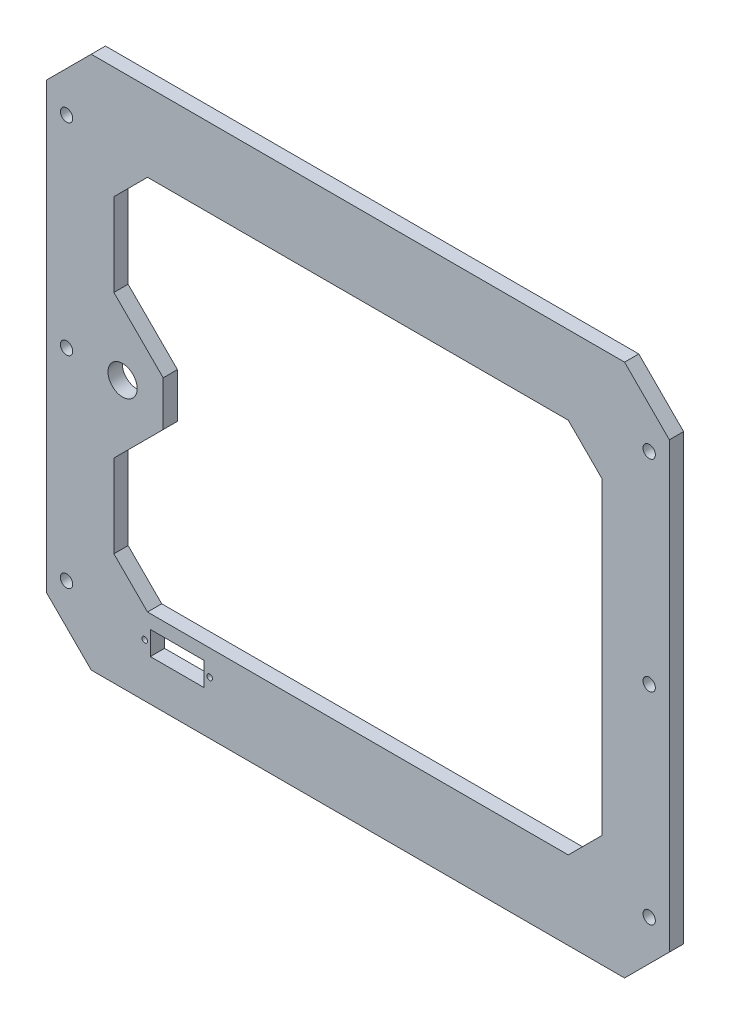
ISO-10303-21;
HEADER;
FILE_DESCRIPTION(('STEP AP214'),'2;1');
FILE_NAME('part.step','',(''),(''),'','','');
FILE_SCHEMA(('AUTOMOTIVE_DESIGN { 1 0 10303 214 1 1 1 1 }'));
ENDSEC;
DATA;
#1=APPLICATION_CONTEXT('core data for automotive mechanical design processes');
#2=APPLICATION_PROTOCOL_DEFINITION('international standard','automotive_design',2000,#1);
#3=PRODUCT_CONTEXT('',#1,'mechanical');
#4=PRODUCT('Part','Part','',(#3));
#5=PRODUCT_RELATED_PRODUCT_CATEGORY('part','',(#4));
#6=PRODUCT_DEFINITION_FORMATION('','',#4);
#7=PRODUCT_DEFINITION_CONTEXT('part definition',#1,'design');
#8=PRODUCT_DEFINITION('design','',#6,#7);
#9=PRODUCT_DEFINITION_SHAPE('','',#8);
#10=(LENGTH_UNIT() NAMED_UNIT(*) SI_UNIT(.MILLI.,.METRE.));
#11=(NAMED_UNIT(*) PLANE_ANGLE_UNIT() SI_UNIT($,.RADIAN.));
#12=(NAMED_UNIT(*) SI_UNIT($,.STERADIAN.) SOLID_ANGLE_UNIT());
#13=UNCERTAINTY_MEASURE_WITH_UNIT(LENGTH_MEASURE(1.E-05),#10,'distance_accuracy_value','');
#14=(GEOMETRIC_REPRESENTATION_CONTEXT(3) GLOBAL_UNCERTAINTY_ASSIGNED_CONTEXT((#13)) GLOBAL_UNIT_ASSIGNED_CONTEXT((#10,
#11,#12)) REPRESENTATION_CONTEXT('',''));
#15=CARTESIAN_POINT('',(0.,0.,0.));
#16=DIRECTION('',(0.,0.,1.));
#17=DIRECTION('',(1.,0.,0.));
#18=AXIS2_PLACEMENT_3D('',#15,#16,#17);
#19=CARTESIAN_POINT('',(-139.,-119.,6.35));
#20=DIRECTION('',(1.,0.,0.));
#21=DIRECTION('',(0.,0.,-1.));
#22=AXIS2_PLACEMENT_3D('',#19,#20,#21);
#23=PLANE('',#22);
#24=DIRECTION('',(0.,-1.,0.));
#25=VECTOR('',#24,1.);
#26=CARTESIAN_POINT('',(-139.,-119.,6.35));
#27=LINE('',#26,#25);
#28=CARTESIAN_POINT('',(-139.,98.9999999999999,6.35));
#29=VERTEX_POINT('',#28);
#30=CARTESIAN_POINT('',(-139.,-98.9999999999999,6.35));
#31=VERTEX_POINT('',#30);
#32=EDGE_CURVE('E322',#29,#31,#27,.T.);
#33=ORIENTED_EDGE('',*,*,#32,.F.);
#34=DIRECTION('',(0.,0.,-1.));
#35=VECTOR('',#34,1.);
#36=CARTESIAN_POINT('',(-139.,99.,6.35));
#37=LINE('',#36,#35);
#38=CARTESIAN_POINT('',(-139.,98.9999999999999,0.));
#39=VERTEX_POINT('',#38);
#40=EDGE_CURVE('E379',#29,#39,#37,.T.);
#41=ORIENTED_EDGE('',*,*,#40,.T.);
#42=DIRECTION('',(0.,-1.,0.));
#43=VECTOR('',#42,1.);
#44=CARTESIAN_POINT('',(-139.,-119.,0.));
#45=LINE('',#44,#43);
#46=CARTESIAN_POINT('',(-139.,-98.9999999999999,0.));
#47=VERTEX_POINT('',#46);
#48=EDGE_CURVE('E336',#39,#47,#45,.T.);
#49=ORIENTED_EDGE('',*,*,#48,.T.);
#50=DIRECTION('',(0.,0.,1.));
#51=VECTOR('',#50,1.);
#52=CARTESIAN_POINT('',(-139.,-98.9999999999999,6.35));
#53=LINE('',#52,#51);
#54=EDGE_CURVE('E377',#47,#31,#53,.T.);
#55=ORIENTED_EDGE('',*,*,#54,.T.);
#56=EDGE_LOOP('',(#33,#41,#49,#55));
#57=FACE_BOUND('',#56,.T.);
#58=ADVANCED_FACE('F33',(#57),#23,.F.);
#59=CARTESIAN_POINT('',(139.,-119.,6.35));
#60=DIRECTION('',(0.,1.,0.));
#61=DIRECTION('',(-1.,0.,0.));
#62=AXIS2_PLACEMENT_3D('',#59,#60,#61);
#63=PLANE('',#62);
#64=DIRECTION('',(1.,0.,0.));
#65=VECTOR('',#64,1.);
#66=CARTESIAN_POINT('',(139.,-119.,0.));
#67=LINE('',#66,#65);
#68=CARTESIAN_POINT('',(-119.,-119.,0.));
#69=VERTEX_POINT('',#68);
#70=CARTESIAN_POINT('',(119.,-119.,0.));
#71=VERTEX_POINT('',#70);
#72=EDGE_CURVE('E339',#69,#71,#67,.T.);
#73=ORIENTED_EDGE('',*,*,#72,.T.);
#74=DIRECTION('',(0.,0.,1.));
#75=VECTOR('',#74,1.);
#76=CARTESIAN_POINT('',(119.,-119.,6.35));
#77=LINE('',#76,#75);
#78=CARTESIAN_POINT('',(119.,-119.,6.35));
#79=VERTEX_POINT('',#78);
#80=EDGE_CURVE('E362',#71,#79,#77,.T.);
#81=ORIENTED_EDGE('',*,*,#80,.T.);
#82=DIRECTION('',(1.,0.,0.));
#83=VECTOR('',#82,1.);
#84=CARTESIAN_POINT('',(139.,-119.,6.35));
#85=LINE('',#84,#83);
#86=CARTESIAN_POINT('',(-119.,-119.,6.35));
#87=VERTEX_POINT('',#86);
#88=EDGE_CURVE('E325',#87,#79,#85,.T.);
#89=ORIENTED_EDGE('',*,*,#88,.F.);
#90=DIRECTION('',(0.,0.,-1.));
#91=VECTOR('',#90,1.);
#92=CARTESIAN_POINT('',(-119.,-119.,6.35));
#93=LINE('',#92,#91);
#94=EDGE_CURVE('E359',#87,#69,#93,.T.);
#95=ORIENTED_EDGE('',*,*,#94,.T.);
#96=EDGE_LOOP('',(#73,#81,#89,#95));
#97=FACE_BOUND('',#96,.T.);
#98=ADVANCED_FACE('F487',(#97),#63,.F.);
#99=CARTESIAN_POINT('',(139.,-119.,6.35));
#100=DIRECTION('',(-1.,0.,0.));
#101=DIRECTION('',(0.,0.,1.));
#102=AXIS2_PLACEMENT_3D('',#99,#100,#101);
#103=PLANE('',#102);
#104=DIRECTION('',(0.,1.,0.));
#105=VECTOR('',#104,1.);
#106=CARTESIAN_POINT('',(139.,-119.,6.35));
#107=LINE('',#106,#105);
#108=CARTESIAN_POINT('',(139.,-99.0000000000001,6.35));
#109=VERTEX_POINT('',#108);
#110=CARTESIAN_POINT('',(139.,98.9999999999999,6.35));
#111=VERTEX_POINT('',#110);
#112=EDGE_CURVE('E329',#109,#111,#107,.T.);
#113=ORIENTED_EDGE('',*,*,#112,.F.);
#114=DIRECTION('',(0.,0.,-1.));
#115=VECTOR('',#114,1.);
#116=CARTESIAN_POINT('',(139.,-99.,6.35));
#117=LINE('',#116,#115);
#118=CARTESIAN_POINT('',(139.,-99.,0.));
#119=VERTEX_POINT('',#118);
#120=EDGE_CURVE('E348',#109,#119,#117,.T.);
#121=ORIENTED_EDGE('',*,*,#120,.T.);
#122=DIRECTION('',(0.,1.,0.));
#123=VECTOR('',#122,1.);
#124=CARTESIAN_POINT('',(139.,-119.,0.));
#125=LINE('',#124,#123);
#126=CARTESIAN_POINT('',(139.,98.9999999999999,0.));
#127=VERTEX_POINT('',#126);
#128=EDGE_CURVE('E342',#119,#127,#125,.T.);
#129=ORIENTED_EDGE('',*,*,#128,.T.);
#130=DIRECTION('',(0.,0.,1.));
#131=VECTOR('',#130,1.);
#132=CARTESIAN_POINT('',(139.,98.9999999999999,6.35));
#133=LINE('',#132,#131);
#134=EDGE_CURVE('E335',#127,#111,#133,.T.);
#135=ORIENTED_EDGE('',*,*,#134,.T.);
#136=EDGE_LOOP('',(#113,#121,#129,#135));
#137=FACE_BOUND('',#136,.T.);
#138=ADVANCED_FACE('F493',(#137),#103,.F.);
#139=CARTESIAN_POINT('',(139.,119.,6.35));
#140=DIRECTION('',(0.,-1.,0.));
#141=DIRECTION('',(1.,0.,0.));
#142=AXIS2_PLACEMENT_3D('',#139,#140,#141);
#143=PLANE('',#142);
#144=DIRECTION('',(-1.,0.,0.));
#145=VECTOR('',#144,1.);
#146=CARTESIAN_POINT('',(139.,119.,6.35));
#147=LINE('',#146,#145);
#148=CARTESIAN_POINT('',(119.,119.,6.35));
#149=VERTEX_POINT('',#148);
#150=CARTESIAN_POINT('',(-119.,119.,6.35));
#151=VERTEX_POINT('',#150);
#152=EDGE_CURVE('E332',#149,#151,#147,.T.);
#153=ORIENTED_EDGE('',*,*,#152,.F.);
#154=DIRECTION('',(0.,0.,-1.));
#155=VECTOR('',#154,1.);
#156=CARTESIAN_POINT('',(119.,119.,6.35));
#157=LINE('',#156,#155);
#158=CARTESIAN_POINT('',(119.,119.,0.));
#159=VERTEX_POINT('',#158);
#160=EDGE_CURVE('E374',#149,#159,#157,.T.);
#161=ORIENTED_EDGE('',*,*,#160,.T.);
#162=DIRECTION('',(-1.,0.,0.));
#163=VECTOR('',#162,1.);
#164=CARTESIAN_POINT('',(139.,119.,0.));
#165=LINE('',#164,#163);
#166=CARTESIAN_POINT('',(-119.,119.,0.));
#167=VERTEX_POINT('',#166);
#168=EDGE_CURVE('E326',#159,#167,#165,.T.);
#169=ORIENTED_EDGE('',*,*,#168,.T.);
#170=DIRECTION('',(0.,0.,1.));
#171=VECTOR('',#170,1.);
#172=CARTESIAN_POINT('',(-119.,119.,6.35));
#173=LINE('',#172,#171);
#174=EDGE_CURVE('E372',#167,#151,#173,.T.);
#175=ORIENTED_EDGE('',*,*,#174,.T.);
#176=EDGE_LOOP('',(#153,#161,#169,#175));
#177=FACE_BOUND('',#176,.T.);
#178=ADVANCED_FACE('F535',(#177),#143,.F.);
#179=CARTESIAN_POINT('',(0.,0.,6.35));
#180=DIRECTION('',(0.,0.,1.));
#181=DIRECTION('',(1.,0.,0.));
#182=AXIS2_PLACEMENT_3D('',#179,#180,#181);
#183=PLANE('',#182);
#184=CARTESIAN_POINT('',(-95.1158414150251,-95.3420570986714,6.35));
#185=DIRECTION('',(0.,0.,1.));
#186=DIRECTION('',(-1.,0.,0.));
#187=AXIS2_PLACEMENT_3D('',#184,#185,#186);
#188=CIRCLE('',#187,1.25);
#189=CARTESIAN_POINT('',(-96.3658414150251,-95.3420570986714,6.35));
#190=VERTEX_POINT('',#189);
#191=EDGE_CURVE('E808',#190,#190,#188,.T.);
#192=ORIENTED_EDGE('',*,*,#191,.F.);
#193=EDGE_LOOP('',(#192));
#194=FACE_BOUND('',#193,.T.);
#195=CARTESIAN_POINT('',(-66.1158414150251,-95.3420570986714,6.35));
#196=DIRECTION('',(0.,0.,1.));
#197=DIRECTION('',(1.,0.,0.));
#198=AXIS2_PLACEMENT_3D('',#195,#196,#197);
#199=CIRCLE('',#198,1.25);
#200=CARTESIAN_POINT('',(-64.8658414150251,-95.3420570986714,6.35));
#201=VERTEX_POINT('',#200);
#202=EDGE_CURVE('E218',#201,#201,#199,.T.);
#203=ORIENTED_EDGE('',*,*,#202,.F.);
#204=EDGE_LOOP('',(#203));
#205=FACE_BOUND('',#204,.T.);
#206=DIRECTION('',(0.,1.,0.));
#207=VECTOR('',#206,1.);
#208=CARTESIAN_POINT('',(-68.6158414150251,-90.0920570986714,6.35));
#209=LINE('',#208,#207);
#210=CARTESIAN_POINT('',(-68.6158414150251,-100.592057098671,6.35));
#211=VERTEX_POINT('',#210);
#212=CARTESIAN_POINT('',(-68.6158414150251,-90.0920570986714,6.35));
#213=VERTEX_POINT('',#212);
#214=EDGE_CURVE('E48',#211,#213,#209,.T.);
#215=ORIENTED_EDGE('',*,*,#214,.F.);
#216=DIRECTION('',(1.,0.,0.));
#217=VECTOR('',#216,1.);
#218=CARTESIAN_POINT('',(-92.6158414150251,-100.592057098671,6.35));
#219=LINE('',#218,#217);
#220=CARTESIAN_POINT('',(-92.6158414150251,-100.592057098671,6.35));
#221=VERTEX_POINT('',#220);
#222=EDGE_CURVE('E212',#221,#211,#219,.T.);
#223=ORIENTED_EDGE('',*,*,#222,.F.);
#224=DIRECTION('',(0.,-1.,0.));
#225=VECTOR('',#224,1.);
#226=CARTESIAN_POINT('',(-92.6158414150251,-90.0920570986714,6.35));
#227=LINE('',#226,#225);
#228=CARTESIAN_POINT('',(-92.6158414150251,-90.0920570986714,6.35));
#229=VERTEX_POINT('',#228);
#230=EDGE_CURVE('E215',#229,#221,#227,.T.);
#231=ORIENTED_EDGE('',*,*,#230,.F.);
#232=DIRECTION('',(-1.,0.,0.));
#233=VECTOR('',#232,1.);
#234=CARTESIAN_POINT('',(-92.6158414150251,-90.0920570986714,6.35));
#235=LINE('',#234,#233);
#236=EDGE_CURVE('E224',#213,#229,#235,.T.);
#237=ORIENTED_EDGE('',*,*,#236,.F.);
#238=EDGE_LOOP('',(#215,#223,#231,#237));
#239=FACE_BOUND('',#238,.T.);
#240=DIRECTION('',(0.,-1.,0.));
#241=VECTOR('',#240,1.);
#242=CARTESIAN_POINT('',(-108.875716073318,32.0000000000003,6.35));
#243=LINE('',#242,#241);
#244=CARTESIAN_POINT('',(-108.875716073318,69.,6.35));
#245=VERTEX_POINT('',#244);
#246=CARTESIAN_POINT('',(-108.875716073318,32.0000000000003,6.35));
#247=VERTEX_POINT('',#246);
#248=EDGE_CURVE('E231',#245,#247,#243,.T.);
#249=ORIENTED_EDGE('',*,*,#248,.F.);
#250=DIRECTION('',(-0.707106781186547,-0.707106781186548,0.));
#251=VECTOR('',#250,1.);
#252=CARTESIAN_POINT('',(-108.875716073318,69.,6.35));
#253=LINE('',#252,#251);
#254=CARTESIAN_POINT('',(-93.875716073318,84.,6.35));
#255=VERTEX_POINT('',#254);
#256=EDGE_CURVE('E266',#255,#245,#253,.T.);
#257=ORIENTED_EDGE('',*,*,#256,.F.);
#258=DIRECTION('',(-1.,0.,0.));
#259=VECTOR('',#258,1.);
#260=CARTESIAN_POINT('',(93.8757160733181,84.,6.35));
#261=LINE('',#260,#259);
#262=CARTESIAN_POINT('',(93.8757160733181,84.,6.35));
#263=VERTEX_POINT('',#262);
#264=EDGE_CURVE('E263',#263,#255,#261,.T.);
#265=ORIENTED_EDGE('',*,*,#264,.F.);
#266=DIRECTION('',(-0.707106781186548,0.707106781186547,0.));
#267=VECTOR('',#266,1.);
#268=CARTESIAN_POINT('',(108.875716073318,69.,6.35));
#269=LINE('',#268,#267);
#270=CARTESIAN_POINT('',(108.875716073318,69.,6.35));
#271=VERTEX_POINT('',#270);
#272=EDGE_CURVE('E260',#271,#263,#269,.T.);
#273=ORIENTED_EDGE('',*,*,#272,.F.);
#274=DIRECTION('',(0.,1.,0.));
#275=VECTOR('',#274,1.);
#276=CARTESIAN_POINT('',(108.875716073318,-69.,6.35));
#277=LINE('',#276,#275);
#278=CARTESIAN_POINT('',(108.875716073318,-69.,6.35));
#279=VERTEX_POINT('',#278);
#280=EDGE_CURVE('E257',#279,#271,#277,.T.);
#281=ORIENTED_EDGE('',*,*,#280,.F.);
#282=DIRECTION('',(0.707106781186547,0.707106781186547,0.));
#283=VECTOR('',#282,1.);
#284=CARTESIAN_POINT('',(93.8757160733181,-84.,6.35));
#285=LINE('',#284,#283);
#286=CARTESIAN_POINT('',(93.8757160733181,-84.,6.35));
#287=VERTEX_POINT('',#286);
#288=EDGE_CURVE('E254',#287,#279,#285,.T.);
#289=ORIENTED_EDGE('',*,*,#288,.F.);
#290=DIRECTION('',(1.,0.,0.));
#291=VECTOR('',#290,1.);
#292=CARTESIAN_POINT('',(93.8757160733181,-84.,6.35));
#293=LINE('',#292,#291);
#294=CARTESIAN_POINT('',(-93.875716073318,-84.,6.35));
#295=VERTEX_POINT('',#294);
#296=EDGE_CURVE('E251',#295,#287,#293,.T.);
#297=ORIENTED_EDGE('',*,*,#296,.F.);
#298=DIRECTION('',(0.707106781186547,-0.707106781186547,0.));
#299=VECTOR('',#298,1.);
#300=CARTESIAN_POINT('',(-93.875716073318,-84.,6.35));
#301=LINE('',#300,#299);
#302=CARTESIAN_POINT('',(-108.875716073318,-69.,6.35));
#303=VERTEX_POINT('',#302);
#304=EDGE_CURVE('E248',#303,#295,#301,.T.);
#305=ORIENTED_EDGE('',*,*,#304,.F.);
#306=DIRECTION('',(0.,-1.,0.));
#307=VECTOR('',#306,1.);
#308=CARTESIAN_POINT('',(-108.875716073318,-69.,6.35));
#309=LINE('',#308,#307);
#310=CARTESIAN_POINT('',(-108.875716073318,-32.0000000000003,6.35));
#311=VERTEX_POINT('',#310);
#312=EDGE_CURVE('E245',#311,#303,#309,.T.);
#313=ORIENTED_EDGE('',*,*,#312,.F.);
#314=DIRECTION('',(-0.707106781186544,-0.707106781186552,0.));
#315=VECTOR('',#314,1.);
#316=CARTESIAN_POINT('',(-108.875716073318,-32.0000000000003,6.35));
#317=LINE('',#316,#315);
#318=CARTESIAN_POINT('',(-86.875716073318,-10.,6.35));
#319=VERTEX_POINT('',#318);
#320=EDGE_CURVE('E242',#319,#311,#317,.T.);
#321=ORIENTED_EDGE('',*,*,#320,.F.);
#322=DIRECTION('',(0.,-1.,0.));
#323=VECTOR('',#322,1.);
#324=CARTESIAN_POINT('',(-86.875716073318,10.,6.35));
#325=LINE('',#324,#323);
#326=CARTESIAN_POINT('',(-86.875716073318,10.,6.35));
#327=VERTEX_POINT('',#326);
#328=EDGE_CURVE('E239',#327,#319,#325,.T.);
#329=ORIENTED_EDGE('',*,*,#328,.F.);
#330=DIRECTION('',(0.707106781186544,-0.707106781186552,0.));
#331=VECTOR('',#330,1.);
#332=CARTESIAN_POINT('',(-108.875716073318,32.0000000000003,6.35));
#333=LINE('',#332,#331);
#334=EDGE_CURVE('E236',#247,#327,#333,.T.);
#335=ORIENTED_EDGE('',*,*,#334,.F.);
#336=EDGE_LOOP('',(#249,#257,#265,#273,#281,#289,#297,#305,#313,#321,#329,#335));
#337=FACE_BOUND('',#336,.T.);
#338=CARTESIAN_POINT('',(-105.,0.,6.35));
#339=DIRECTION('',(0.,0.,1.));
#340=DIRECTION('',(1.,0.,0.));
#341=AXIS2_PLACEMENT_3D('',#338,#339,#340);
#342=CIRCLE('',#341,6.5);
#343=CARTESIAN_POINT('',(-98.5,0.,6.35));
#344=VERTEX_POINT('',#343);
#345=EDGE_CURVE('E272',#344,#344,#342,.T.);
#346=ORIENTED_EDGE('',*,*,#345,.F.);
#347=EDGE_LOOP('',(#346));
#348=FACE_BOUND('',#347,.T.);
#349=CARTESIAN_POINT('',(130.,90.,6.35));
#350=DIRECTION('',(0.,0.,1.));
#351=DIRECTION('',(-1.,0.,0.));
#352=AXIS2_PLACEMENT_3D('',#349,#350,#351);
#353=CIRCLE('',#352,2.75000000000001);
#354=CARTESIAN_POINT('',(127.25,90.,6.35));
#355=VERTEX_POINT('',#354);
#356=EDGE_CURVE('E298',#355,#355,#353,.T.);
#357=ORIENTED_EDGE('',*,*,#356,.F.);
#358=EDGE_LOOP('',(#357));
#359=FACE_BOUND('',#358,.T.);
#360=CARTESIAN_POINT('',(129.999999999998,0.,6.35));
#361=DIRECTION('',(0.,0.,1.));
#362=DIRECTION('',(-1.,0.,0.));
#363=AXIS2_PLACEMENT_3D('',#360,#361,#362);
#364=CIRCLE('',#363,2.75000000000001);
#365=CARTESIAN_POINT('',(127.249999999998,0.,6.35));
#366=VERTEX_POINT('',#365);
#367=EDGE_CURVE('E302',#366,#366,#364,.T.);
#368=ORIENTED_EDGE('',*,*,#367,.F.);
#369=EDGE_LOOP('',(#368));
#370=FACE_BOUND('',#369,.T.);
#371=CARTESIAN_POINT('',(130.,-90.,6.35));
#372=DIRECTION('',(0.,0.,1.));
#373=DIRECTION('',(1.,0.,0.));
#374=AXIS2_PLACEMENT_3D('',#371,#372,#373);
#375=CIRCLE('',#374,2.75000000000001);
#376=CARTESIAN_POINT('',(132.75,-90.,6.35));
#377=VERTEX_POINT('',#376);
#378=EDGE_CURVE('E306',#377,#377,#375,.T.);
#379=ORIENTED_EDGE('',*,*,#378,.F.);
#380=EDGE_LOOP('',(#379));
#381=FACE_BOUND('',#380,.T.);
#382=CARTESIAN_POINT('',(-129.999999999998,0.,6.35));
#383=DIRECTION('',(0.,0.,1.));
#384=DIRECTION('',(1.,0.,0.));
#385=AXIS2_PLACEMENT_3D('',#382,#383,#384);
#386=CIRCLE('',#385,2.75000000000001);
#387=CARTESIAN_POINT('',(-127.249999999998,0.,6.35));
#388=VERTEX_POINT('',#387);
#389=EDGE_CURVE('E310',#388,#388,#386,.T.);
#390=ORIENTED_EDGE('',*,*,#389,.F.);
#391=EDGE_LOOP('',(#390));
#392=FACE_BOUND('',#391,.T.);
#393=CARTESIAN_POINT('',(-130.,-90.,6.35));
#394=DIRECTION('',(0.,0.,1.));
#395=DIRECTION('',(-1.,0.,0.));
#396=AXIS2_PLACEMENT_3D('',#393,#394,#395);
#397=CIRCLE('',#396,2.75000000000001);
#398=CARTESIAN_POINT('',(-132.75,-90.,6.35));
#399=VERTEX_POINT('',#398);
#400=EDGE_CURVE('E314',#399,#399,#397,.T.);
#401=ORIENTED_EDGE('',*,*,#400,.F.);
#402=EDGE_LOOP('',(#401));
#403=FACE_BOUND('',#402,.T.);
#404=CARTESIAN_POINT('',(-130.,90.,6.35));
#405=DIRECTION('',(0.,0.,1.));
#406=DIRECTION('',(1.,0.,0.));
#407=AXIS2_PLACEMENT_3D('',#404,#405,#406);
#408=CIRCLE('',#407,2.75000000000001);
#409=CARTESIAN_POINT('',(-127.25,90.,6.35));
#410=VERTEX_POINT('',#409);
#411=EDGE_CURVE('E318',#410,#410,#408,.T.);
#412=ORIENTED_EDGE('',*,*,#411,.F.);
#413=EDGE_LOOP('',(#412));
#414=FACE_BOUND('',#413,.T.);
#415=ORIENTED_EDGE('',*,*,#88,.T.);
#416=DIRECTION('',(-0.707106781186549,-0.707106781186547,0.));
#417=VECTOR('',#416,1.);
#418=CARTESIAN_POINT('',(119.,-119.,6.35));
#419=LINE('',#418,#417);
#420=EDGE_CURVE('E370',#79,#109,#419,.F.);
#421=ORIENTED_EDGE('',*,*,#420,.T.);
#422=ORIENTED_EDGE('',*,*,#112,.T.);
#423=DIRECTION('',(0.707106781186545,-0.70710678118655,0.));
#424=VECTOR('',#423,1.);
#425=CARTESIAN_POINT('',(119.000000000001,119.,6.35));
#426=LINE('',#425,#424);
#427=EDGE_CURVE('E368',#111,#149,#426,.F.);
#428=ORIENTED_EDGE('',*,*,#427,.T.);
#429=ORIENTED_EDGE('',*,*,#152,.T.);
#430=DIRECTION('',(0.707106781186548,0.707106781186547,0.));
#431=VECTOR('',#430,1.);
#432=CARTESIAN_POINT('',(-119.,119.,6.35));
#433=LINE('',#432,#431);
#434=EDGE_CURVE('E366',#151,#29,#433,.F.);
#435=ORIENTED_EDGE('',*,*,#434,.T.);
#436=ORIENTED_EDGE('',*,*,#32,.T.);
#437=DIRECTION('',(-0.707106781186546,0.70710678118655,0.));
#438=VECTOR('',#437,1.);
#439=CARTESIAN_POINT('',(-119.,-119.,6.35));
#440=LINE('',#439,#438);
#441=EDGE_CURVE('E364',#31,#87,#440,.F.);
#442=ORIENTED_EDGE('',*,*,#441,.T.);
#443=EDGE_LOOP('',(#415,#421,#422,#428,#429,#435,#436,#442));
#444=FACE_BOUND('',#443,.T.);
#445=ADVANCED_FACE('F439',(#194,#205,#239,#337,#348,#359,#370,#381,#392,#403,#414,#444),#183,.T.);
#446=CARTESIAN_POINT('',(0.,0.,0.));
#447=DIRECTION('',(0.,0.,1.));
#448=DIRECTION('',(1.,0.,0.));
#449=AXIS2_PLACEMENT_3D('',#446,#447,#448);
#450=PLANE('',#449);
#451=CARTESIAN_POINT('',(-95.1158414150251,-95.3420570986714,0.));
#452=DIRECTION('',(0.,0.,1.));
#453=DIRECTION('',(-1.,0.,0.));
#454=AXIS2_PLACEMENT_3D('',#451,#452,#453);
#455=CIRCLE('',#454,1.25);
#456=CARTESIAN_POINT('',(-96.3658414150251,-95.3420570986714,0.));
#457=VERTEX_POINT('',#456);
#458=EDGE_CURVE('E805',#457,#457,#455,.T.);
#459=ORIENTED_EDGE('',*,*,#458,.T.);
#460=EDGE_LOOP('',(#459));
#461=FACE_BOUND('',#460,.T.);
#462=CARTESIAN_POINT('',(-66.1158414150251,-95.3420570986714,0.));
#463=DIRECTION('',(0.,0.,1.));
#464=DIRECTION('',(1.,0.,0.));
#465=AXIS2_PLACEMENT_3D('',#462,#463,#464);
#466=CIRCLE('',#465,1.25);
#467=CARTESIAN_POINT('',(-64.8658414150251,-95.3420570986714,0.));
#468=VERTEX_POINT('',#467);
#469=EDGE_CURVE('E225',#468,#468,#466,.T.);
#470=ORIENTED_EDGE('',*,*,#469,.T.);
#471=EDGE_LOOP('',(#470));
#472=FACE_BOUND('',#471,.T.);
#473=DIRECTION('',(1.,0.,0.));
#474=VECTOR('',#473,1.);
#475=CARTESIAN_POINT('',(-92.6158414150251,-100.592057098671,0.));
#476=LINE('',#475,#474);
#477=CARTESIAN_POINT('',(-92.6158414150251,-100.592057098671,0.));
#478=VERTEX_POINT('',#477);
#479=CARTESIAN_POINT('',(-68.6158414150251,-100.592057098671,0.));
#480=VERTEX_POINT('',#479);
#481=EDGE_CURVE('E202',#478,#480,#476,.T.);
#482=ORIENTED_EDGE('',*,*,#481,.T.);
#483=DIRECTION('',(0.,1.,0.));
#484=VECTOR('',#483,1.);
#485=CARTESIAN_POINT('',(-68.6158414150251,-90.0920570986714,0.));
#486=LINE('',#485,#484);
#487=CARTESIAN_POINT('',(-68.6158414150251,-90.0920570986714,0.));
#488=VERTEX_POINT('',#487);
#489=EDGE_CURVE('E196',#480,#488,#486,.T.);
#490=ORIENTED_EDGE('',*,*,#489,.T.);
#491=DIRECTION('',(-1.,0.,0.));
#492=VECTOR('',#491,1.);
#493=CARTESIAN_POINT('',(-92.6158414150251,-90.0920570986714,0.));
#494=LINE('',#493,#492);
#495=CARTESIAN_POINT('',(-92.6158414150251,-90.0920570986714,0.));
#496=VERTEX_POINT('',#495);
#497=EDGE_CURVE('E205',#488,#496,#494,.T.);
#498=ORIENTED_EDGE('',*,*,#497,.T.);
#499=DIRECTION('',(0.,-1.,0.));
#500=VECTOR('',#499,1.);
#501=CARTESIAN_POINT('',(-92.6158414150251,-90.0920570986714,0.));
#502=LINE('',#501,#500);
#503=EDGE_CURVE('E56',#496,#478,#502,.T.);
#504=ORIENTED_EDGE('',*,*,#503,.T.);
#505=EDGE_LOOP('',(#482,#490,#498,#504));
#506=FACE_BOUND('',#505,.T.);
#507=DIRECTION('',(-0.707106781186547,-0.707106781186548,0.));
#508=VECTOR('',#507,1.);
#509=CARTESIAN_POINT('',(-88.9378580366591,88.937858036659,0.));
#510=LINE('',#509,#508);
#511=CARTESIAN_POINT('',(-93.875716073318,84.,0.));
#512=VERTEX_POINT('',#511);
#513=CARTESIAN_POINT('',(-108.875716073318,69.,0.));
#514=VERTEX_POINT('',#513);
#515=EDGE_CURVE('E41',#512,#514,#510,.T.);
#516=ORIENTED_EDGE('',*,*,#515,.T.);
#517=DIRECTION('',(0.,-1.,0.));
#518=VECTOR('',#517,1.);
#519=CARTESIAN_POINT('',(-108.875716073318,0.,0.));
#520=LINE('',#519,#518);
#521=CARTESIAN_POINT('',(-108.875716073318,32.0000000000003,0.));
#522=VERTEX_POINT('',#521);
#523=EDGE_CURVE('E11',#514,#522,#520,.T.);
#524=ORIENTED_EDGE('',*,*,#523,.T.);
#525=DIRECTION('',(0.707106781186544,-0.707106781186551,0.));
#526=VECTOR('',#525,1.);
#527=CARTESIAN_POINT('',(-38.4378580366595,-38.4378580366591,0.));
#528=LINE('',#527,#526);
#529=CARTESIAN_POINT('',(-86.875716073318,10.,0.));
#530=VERTEX_POINT('',#529);
#531=EDGE_CURVE('E382',#522,#530,#528,.T.);
#532=ORIENTED_EDGE('',*,*,#531,.T.);
#533=DIRECTION('',(0.,-1.,0.));
#534=VECTOR('',#533,1.);
#535=CARTESIAN_POINT('',(-86.875716073318,0.,0.));
#536=LINE('',#535,#534);
#537=CARTESIAN_POINT('',(-86.875716073318,-10.,0.));
#538=VERTEX_POINT('',#537);
#539=EDGE_CURVE('E399',#530,#538,#536,.T.);
#540=ORIENTED_EDGE('',*,*,#539,.T.);
#541=DIRECTION('',(-0.707106781186544,-0.707106781186551,0.));
#542=VECTOR('',#541,1.);
#543=CARTESIAN_POINT('',(-38.4378580366595,38.4378580366591,0.));
#544=LINE('',#543,#542);
#545=CARTESIAN_POINT('',(-108.875716073318,-32.0000000000003,0.));
#546=VERTEX_POINT('',#545);
#547=EDGE_CURVE('E402',#538,#546,#544,.T.);
#548=ORIENTED_EDGE('',*,*,#547,.T.);
#549=DIRECTION('',(0.,-1.,0.));
#550=VECTOR('',#549,1.);
#551=CARTESIAN_POINT('',(-108.875716073318,0.,0.));
#552=LINE('',#551,#550);
#553=CARTESIAN_POINT('',(-108.875716073318,-69.,0.));
#554=VERTEX_POINT('',#553);
#555=EDGE_CURVE('E405',#546,#554,#552,.T.);
#556=ORIENTED_EDGE('',*,*,#555,.T.);
#557=DIRECTION('',(0.707106781186548,-0.707106781186548,0.));
#558=VECTOR('',#557,1.);
#559=CARTESIAN_POINT('',(-88.937858036659,-88.937858036659,0.));
#560=LINE('',#559,#558);
#561=CARTESIAN_POINT('',(-93.875716073318,-84.,0.));
#562=VERTEX_POINT('',#561);
#563=EDGE_CURVE('E408',#554,#562,#560,.T.);
#564=ORIENTED_EDGE('',*,*,#563,.T.);
#565=DIRECTION('',(1.,0.,0.));
#566=VECTOR('',#565,1.);
#567=CARTESIAN_POINT('',(0.,-84.,0.));
#568=LINE('',#567,#566);
#569=CARTESIAN_POINT('',(93.8757160733181,-84.,0.));
#570=VERTEX_POINT('',#569);
#571=EDGE_CURVE('E411',#562,#570,#568,.T.);
#572=ORIENTED_EDGE('',*,*,#571,.T.);
#573=DIRECTION('',(0.707106781186548,0.707106781186548,0.));
#574=VECTOR('',#573,1.);
#575=CARTESIAN_POINT('',(88.937858036659,-88.937858036659,0.));
#576=LINE('',#575,#574);
#577=CARTESIAN_POINT('',(108.875716073318,-69.,0.));
#578=VERTEX_POINT('',#577);
#579=EDGE_CURVE('E414',#570,#578,#576,.T.);
#580=ORIENTED_EDGE('',*,*,#579,.T.);
#581=DIRECTION('',(0.,1.,0.));
#582=VECTOR('',#581,1.);
#583=CARTESIAN_POINT('',(108.875716073318,0.,0.));
#584=LINE('',#583,#582);
#585=CARTESIAN_POINT('',(108.875716073318,69.,0.));
#586=VERTEX_POINT('',#585);
#587=EDGE_CURVE('E417',#578,#586,#584,.T.);
#588=ORIENTED_EDGE('',*,*,#587,.T.);
#589=DIRECTION('',(-0.707106781186548,0.707106781186547,0.));
#590=VECTOR('',#589,1.);
#591=CARTESIAN_POINT('',(88.937858036659,88.9378580366591,0.));
#592=LINE('',#591,#590);
#593=CARTESIAN_POINT('',(93.8757160733181,84.,0.));
#594=VERTEX_POINT('',#593);
#595=EDGE_CURVE('E420',#586,#594,#592,.T.);
#596=ORIENTED_EDGE('',*,*,#595,.T.);
#597=DIRECTION('',(-1.,0.,0.));
#598=VECTOR('',#597,1.);
#599=CARTESIAN_POINT('',(0.,84.,0.));
#600=LINE('',#599,#598);
#601=EDGE_CURVE('E423',#594,#512,#600,.T.);
#602=ORIENTED_EDGE('',*,*,#601,.T.);
#603=EDGE_LOOP('',(#516,#524,#532,#540,#548,#556,#564,#572,#580,#588,#596,#602));
#604=FACE_BOUND('',#603,.T.);
#605=CARTESIAN_POINT('',(-105.,0.,0.));
#606=DIRECTION('',(0.,0.,1.));
#607=DIRECTION('',(1.,0.,0.));
#608=AXIS2_PLACEMENT_3D('',#605,#606,#607);
#609=CIRCLE('',#608,6.5);
#610=CARTESIAN_POINT('',(-98.5,0.,0.));
#611=VERTEX_POINT('',#610);
#612=EDGE_CURVE('E297',#611,#611,#609,.T.);
#613=ORIENTED_EDGE('',*,*,#612,.T.);
#614=EDGE_LOOP('',(#613));
#615=FACE_BOUND('',#614,.T.);
#616=CARTESIAN_POINT('',(130.,90.,0.));
#617=DIRECTION('',(0.,0.,1.));
#618=DIRECTION('',(1.,0.,0.));
#619=AXIS2_PLACEMENT_3D('',#616,#617,#618);
#620=CIRCLE('',#619,2.75000000000001);
#621=CARTESIAN_POINT('',(132.75,90.,0.));
#622=VERTEX_POINT('',#621);
#623=EDGE_CURVE('E301',#622,#622,#620,.T.);
#624=ORIENTED_EDGE('',*,*,#623,.T.);
#625=EDGE_LOOP('',(#624));
#626=FACE_BOUND('',#625,.T.);
#627=CARTESIAN_POINT('',(129.999999999998,0.,0.));
#628=DIRECTION('',(0.,0.,1.));
#629=DIRECTION('',(1.,0.,0.));
#630=AXIS2_PLACEMENT_3D('',#627,#628,#629);
#631=CIRCLE('',#630,2.75000000000001);
#632=CARTESIAN_POINT('',(132.749999999998,0.,0.));
#633=VERTEX_POINT('',#632);
#634=EDGE_CURVE('E305',#633,#633,#631,.T.);
#635=ORIENTED_EDGE('',*,*,#634,.T.);
#636=EDGE_LOOP('',(#635));
#637=FACE_BOUND('',#636,.T.);
#638=CARTESIAN_POINT('',(130.,-90.,0.));
#639=DIRECTION('',(0.,0.,1.));
#640=DIRECTION('',(1.,0.,0.));
#641=AXIS2_PLACEMENT_3D('',#638,#639,#640);
#642=CIRCLE('',#641,2.75000000000001);
#643=CARTESIAN_POINT('',(132.75,-90.,0.));
#644=VERTEX_POINT('',#643);
#645=EDGE_CURVE('E309',#644,#644,#642,.T.);
#646=ORIENTED_EDGE('',*,*,#645,.T.);
#647=EDGE_LOOP('',(#646));
#648=FACE_BOUND('',#647,.T.);
#649=CARTESIAN_POINT('',(-129.999999999998,0.,0.));
#650=DIRECTION('',(0.,0.,1.));
#651=DIRECTION('',(1.,0.,0.));
#652=AXIS2_PLACEMENT_3D('',#649,#650,#651);
#653=CIRCLE('',#652,2.75000000000001);
#654=CARTESIAN_POINT('',(-127.249999999998,0.,0.));
#655=VERTEX_POINT('',#654);
#656=EDGE_CURVE('E313',#655,#655,#653,.T.);
#657=ORIENTED_EDGE('',*,*,#656,.T.);
#658=EDGE_LOOP('',(#657));
#659=FACE_BOUND('',#658,.T.);
#660=CARTESIAN_POINT('',(-130.,-90.,0.));
#661=DIRECTION('',(0.,0.,1.));
#662=DIRECTION('',(1.,0.,0.));
#663=AXIS2_PLACEMENT_3D('',#660,#661,#662);
#664=CIRCLE('',#663,2.75000000000001);
#665=CARTESIAN_POINT('',(-127.25,-90.,0.));
#666=VERTEX_POINT('',#665);
#667=EDGE_CURVE('E317',#666,#666,#664,.T.);
#668=ORIENTED_EDGE('',*,*,#667,.T.);
#669=EDGE_LOOP('',(#668));
#670=FACE_BOUND('',#669,.T.);
#671=CARTESIAN_POINT('',(-130.,90.,0.));
#672=DIRECTION('',(0.,0.,1.));
#673=DIRECTION('',(1.,0.,0.));
#674=AXIS2_PLACEMENT_3D('',#671,#672,#673);
#675=CIRCLE('',#674,2.75000000000001);
#676=CARTESIAN_POINT('',(-127.25,90.,0.));
#677=VERTEX_POINT('',#676);
#678=EDGE_CURVE('E321',#677,#677,#675,.T.);
#679=ORIENTED_EDGE('',*,*,#678,.T.);
#680=EDGE_LOOP('',(#679));
#681=FACE_BOUND('',#680,.T.);
#682=ORIENTED_EDGE('',*,*,#128,.F.);
#683=DIRECTION('',(0.707106781186549,0.707106781186547,0.));
#684=VECTOR('',#683,1.);
#685=CARTESIAN_POINT('',(139.,-99.,0.));
#686=LINE('',#685,#684);
#687=EDGE_CURVE('E357',#119,#71,#686,.F.);
#688=ORIENTED_EDGE('',*,*,#687,.T.);
#689=ORIENTED_EDGE('',*,*,#72,.F.);
#690=DIRECTION('',(0.707106781186546,-0.70710678118655,0.));
#691=VECTOR('',#690,1.);
#692=CARTESIAN_POINT('',(-119.,-119.,0.));
#693=LINE('',#692,#691);
#694=EDGE_CURVE('E351',#69,#47,#693,.F.);
#695=ORIENTED_EDGE('',*,*,#694,.T.);
#696=ORIENTED_EDGE('',*,*,#48,.F.);
#697=DIRECTION('',(-0.707106781186548,-0.707106781186547,0.));
#698=VECTOR('',#697,1.);
#699=CARTESIAN_POINT('',(-139.,99.,0.));
#700=LINE('',#699,#698);
#701=EDGE_CURVE('E353',#39,#167,#700,.F.);
#702=ORIENTED_EDGE('',*,*,#701,.T.);
#703=ORIENTED_EDGE('',*,*,#168,.F.);
#704=DIRECTION('',(-0.707106781186545,0.70710678118655,0.));
#705=VECTOR('',#704,1.);
#706=CARTESIAN_POINT('',(119.,119.,0.));
#707=LINE('',#706,#705);
#708=EDGE_CURVE('E355',#159,#127,#707,.F.);
#709=ORIENTED_EDGE('',*,*,#708,.T.);
#710=EDGE_LOOP('',(#682,#688,#689,#695,#696,#702,#703,#709));
#711=FACE_BOUND('',#710,.T.);
#712=ADVANCED_FACE('F209',(#461,#472,#506,#604,#615,#626,#637,#648,#659,#670,#681,#711),#450,.F.);
#713=CARTESIAN_POINT('',(139.,-99.,6.35));
#714=DIRECTION('',(-0.707106781186546,0.707106781186548,0.));
#715=DIRECTION('',(0.,0.,-1.));
#716=AXIS2_PLACEMENT_3D('',#713,#714,#715);
#717=PLANE('',#716);
#718=ORIENTED_EDGE('',*,*,#420,.F.);
#719=ORIENTED_EDGE('',*,*,#80,.F.);
#720=ORIENTED_EDGE('',*,*,#687,.F.);
#721=ORIENTED_EDGE('',*,*,#120,.F.);
#722=EDGE_LOOP('',(#718,#719,#720,#721));
#723=FACE_BOUND('',#722,.T.);
#724=ADVANCED_FACE('F499',(#723),#717,.F.);
#725=CARTESIAN_POINT('',(119.,119.,6.35));
#726=DIRECTION('',(-0.707106781186551,-0.707106781186545,0.));
#727=DIRECTION('',(0.,0.,-1.));
#728=AXIS2_PLACEMENT_3D('',#725,#726,#727);
#729=PLANE('',#728);
#730=ORIENTED_EDGE('',*,*,#427,.F.);
#731=ORIENTED_EDGE('',*,*,#134,.F.);
#732=ORIENTED_EDGE('',*,*,#708,.F.);
#733=ORIENTED_EDGE('',*,*,#160,.F.);
#734=EDGE_LOOP('',(#730,#731,#732,#733));
#735=FACE_BOUND('',#734,.T.);
#736=ADVANCED_FACE('F502',(#735),#729,.F.);
#737=CARTESIAN_POINT('',(-139.,99.,6.35));
#738=DIRECTION('',(0.707106781186547,-0.707106781186548,0.));
#739=DIRECTION('',(0.,0.,-1.));
#740=AXIS2_PLACEMENT_3D('',#737,#738,#739);
#741=PLANE('',#740);
#742=ORIENTED_EDGE('',*,*,#434,.F.);
#743=ORIENTED_EDGE('',*,*,#174,.F.);
#744=ORIENTED_EDGE('',*,*,#701,.F.);
#745=ORIENTED_EDGE('',*,*,#40,.F.);
#746=EDGE_LOOP('',(#742,#743,#744,#745));
#747=FACE_BOUND('',#746,.T.);
#748=ADVANCED_FACE('F505',(#747),#741,.F.);
#749=CARTESIAN_POINT('',(-119.,-119.,6.35));
#750=DIRECTION('',(0.707106781186549,0.707106781186545,0.));
#751=DIRECTION('',(0.,0.,-1.));
#752=AXIS2_PLACEMENT_3D('',#749,#750,#751);
#753=PLANE('',#752);
#754=ORIENTED_EDGE('',*,*,#441,.F.);
#755=ORIENTED_EDGE('',*,*,#54,.F.);
#756=ORIENTED_EDGE('',*,*,#694,.F.);
#757=ORIENTED_EDGE('',*,*,#94,.F.);
#758=EDGE_LOOP('',(#754,#755,#756,#757));
#759=FACE_BOUND('',#758,.T.);
#760=ADVANCED_FACE('F35',(#759),#753,.F.);
#761=CARTESIAN_POINT('',(-130.,90.,-69.85));
#762=DIRECTION('',(0.,0.,1.));
#763=DIRECTION('',(1.,0.,0.));
#764=AXIS2_PLACEMENT_3D('',#761,#762,#763);
#765=CYLINDRICAL_SURFACE('',#764,2.75000000000001);
#766=ORIENTED_EDGE('',*,*,#411,.T.);
#767=EDGE_LOOP('',(#766));
#768=FACE_BOUND('',#767,.T.);
#769=ORIENTED_EDGE('',*,*,#678,.F.);
#770=EDGE_LOOP('',(#769));
#771=FACE_BOUND('',#770,.T.);
#772=ADVANCED_FACE('F512',(#768,#771),#765,.F.);
#773=CARTESIAN_POINT('',(-130.,-90.,-69.85));
#774=DIRECTION('',(0.,0.,1.));
#775=DIRECTION('',(1.,0.,0.));
#776=AXIS2_PLACEMENT_3D('',#773,#774,#775);
#777=CYLINDRICAL_SURFACE('',#776,2.75000000000001);
#778=ORIENTED_EDGE('',*,*,#400,.T.);
#779=EDGE_LOOP('',(#778));
#780=FACE_BOUND('',#779,.T.);
#781=ORIENTED_EDGE('',*,*,#667,.F.);
#782=EDGE_LOOP('',(#781));
#783=FACE_BOUND('',#782,.T.);
#784=ADVANCED_FACE('F599',(#780,#783),#777,.F.);
#785=CARTESIAN_POINT('',(-129.999999999998,0.,-69.85));
#786=DIRECTION('',(0.,0.,1.));
#787=DIRECTION('',(1.,0.,0.));
#788=AXIS2_PLACEMENT_3D('',#785,#786,#787);
#789=CYLINDRICAL_SURFACE('',#788,2.75000000000001);
#790=ORIENTED_EDGE('',*,*,#389,.T.);
#791=EDGE_LOOP('',(#790));
#792=FACE_BOUND('',#791,.T.);
#793=ORIENTED_EDGE('',*,*,#656,.F.);
#794=EDGE_LOOP('',(#793));
#795=FACE_BOUND('',#794,.T.);
#796=ADVANCED_FACE('F608',(#792,#795),#789,.F.);
#797=CARTESIAN_POINT('',(130.,-90.,-69.85));
#798=DIRECTION('',(0.,0.,1.));
#799=DIRECTION('',(1.,0.,0.));
#800=AXIS2_PLACEMENT_3D('',#797,#798,#799);
#801=CYLINDRICAL_SURFACE('',#800,2.75000000000001);
#802=ORIENTED_EDGE('',*,*,#378,.T.);
#803=EDGE_LOOP('',(#802));
#804=FACE_BOUND('',#803,.T.);
#805=ORIENTED_EDGE('',*,*,#645,.F.);
#806=EDGE_LOOP('',(#805));
#807=FACE_BOUND('',#806,.T.);
#808=ADVANCED_FACE('F618',(#804,#807),#801,.F.);
#809=CARTESIAN_POINT('',(129.999999999998,0.,-69.85));
#810=DIRECTION('',(0.,0.,1.));
#811=DIRECTION('',(1.,0.,0.));
#812=AXIS2_PLACEMENT_3D('',#809,#810,#811);
#813=CYLINDRICAL_SURFACE('',#812,2.75000000000001);
#814=ORIENTED_EDGE('',*,*,#367,.T.);
#815=EDGE_LOOP('',(#814));
#816=FACE_BOUND('',#815,.T.);
#817=ORIENTED_EDGE('',*,*,#634,.F.);
#818=EDGE_LOOP('',(#817));
#819=FACE_BOUND('',#818,.T.);
#820=ADVANCED_FACE('F628',(#816,#819),#813,.F.);
#821=CARTESIAN_POINT('',(130.,90.,-69.85));
#822=DIRECTION('',(0.,0.,1.));
#823=DIRECTION('',(1.,0.,0.));
#824=AXIS2_PLACEMENT_3D('',#821,#822,#823);
#825=CYLINDRICAL_SURFACE('',#824,2.75000000000001);
#826=ORIENTED_EDGE('',*,*,#356,.T.);
#827=EDGE_LOOP('',(#826));
#828=FACE_BOUND('',#827,.T.);
#829=ORIENTED_EDGE('',*,*,#623,.F.);
#830=EDGE_LOOP('',(#829));
#831=FACE_BOUND('',#830,.T.);
#832=ADVANCED_FACE('F638',(#828,#831),#825,.F.);
#833=CARTESIAN_POINT('',(-105.,0.,-3.65));
#834=DIRECTION('',(0.,0.,1.));
#835=DIRECTION('',(1.,0.,0.));
#836=AXIS2_PLACEMENT_3D('',#833,#834,#835);
#837=CYLINDRICAL_SURFACE('',#836,6.5);
#838=ORIENTED_EDGE('',*,*,#345,.T.);
#839=EDGE_LOOP('',(#838));
#840=FACE_BOUND('',#839,.T.);
#841=ORIENTED_EDGE('',*,*,#612,.F.);
#842=EDGE_LOOP('',(#841));
#843=FACE_BOUND('',#842,.T.);
#844=ADVANCED_FACE('F648',(#840,#843),#837,.F.);
#845=CARTESIAN_POINT('',(-108.875716073318,32.0000000000003,-3.65));
#846=DIRECTION('',(-1.,0.,0.));
#847=DIRECTION('',(0.,0.,1.));
#848=AXIS2_PLACEMENT_3D('',#845,#846,#847);
#849=PLANE('',#848);
#850=DIRECTION('',(0.,0.,1.));
#851=VECTOR('',#850,1.);
#852=CARTESIAN_POINT('',(-108.875716073318,69.,-3.65));
#853=LINE('',#852,#851);
#854=EDGE_CURVE('E270',#514,#245,#853,.T.);
#855=ORIENTED_EDGE('',*,*,#854,.T.);
#856=ORIENTED_EDGE('',*,*,#248,.T.);
#857=DIRECTION('',(0.,0.,1.));
#858=VECTOR('',#857,1.);
#859=CARTESIAN_POINT('',(-108.875716073318,32.0000000000003,-3.65));
#860=LINE('',#859,#858);
#861=EDGE_CURVE('E269',#522,#247,#860,.T.);
#862=ORIENTED_EDGE('',*,*,#861,.F.);
#863=ORIENTED_EDGE('',*,*,#523,.F.);
#864=EDGE_LOOP('',(#855,#856,#862,#863));
#865=FACE_BOUND('',#864,.T.);
#866=ADVANCED_FACE('F445',(#865),#849,.F.);
#867=CARTESIAN_POINT('',(-108.875716073318,69.,-3.65));
#868=DIRECTION('',(-0.707106781186548,0.707106781186547,0.));
#869=DIRECTION('',(-0.707106781186547,-0.707106781186548,0.));
#870=AXIS2_PLACEMENT_3D('',#867,#868,#869);
#871=PLANE('',#870);
#872=DIRECTION('',(0.,0.,1.));
#873=VECTOR('',#872,1.);
#874=CARTESIAN_POINT('',(-93.875716073318,84.,-3.65));
#875=LINE('',#874,#873);
#876=EDGE_CURVE('E273',#512,#255,#875,.T.);
#877=ORIENTED_EDGE('',*,*,#876,.T.);
#878=ORIENTED_EDGE('',*,*,#256,.T.);
#879=ORIENTED_EDGE('',*,*,#854,.F.);
#880=ORIENTED_EDGE('',*,*,#515,.F.);
#881=EDGE_LOOP('',(#877,#878,#879,#880));
#882=FACE_BOUND('',#881,.T.);
#883=ADVANCED_FACE('F430',(#882),#871,.F.);
#884=CARTESIAN_POINT('',(93.8757160733181,84.,-3.65));
#885=DIRECTION('',(0.,1.,0.));
#886=DIRECTION('',(0.,0.,1.));
#887=AXIS2_PLACEMENT_3D('',#884,#885,#886);
#888=PLANE('',#887);
#889=DIRECTION('',(0.,0.,1.));
#890=VECTOR('',#889,1.);
#891=CARTESIAN_POINT('',(93.8757160733181,84.,-3.65));
#892=LINE('',#891,#890);
#893=EDGE_CURVE('E275',#594,#263,#892,.T.);
#894=ORIENTED_EDGE('',*,*,#893,.T.);
#895=ORIENTED_EDGE('',*,*,#264,.T.);
#896=ORIENTED_EDGE('',*,*,#876,.F.);
#897=ORIENTED_EDGE('',*,*,#601,.F.);
#898=EDGE_LOOP('',(#894,#895,#896,#897));
#899=FACE_BOUND('',#898,.T.);
#900=ADVANCED_FACE('F432',(#899),#888,.F.);
#901=CARTESIAN_POINT('',(108.875716073318,69.,-3.65));
#902=DIRECTION('',(0.707106781186547,0.707106781186548,0.));
#903=DIRECTION('',(-0.707106781186548,0.707106781186547,0.));
#904=AXIS2_PLACEMENT_3D('',#901,#902,#903);
#905=PLANE('',#904);
#906=DIRECTION('',(0.,0.,1.));
#907=VECTOR('',#906,1.);
#908=CARTESIAN_POINT('',(108.875716073318,69.,-3.65));
#909=LINE('',#908,#907);
#910=EDGE_CURVE('E277',#586,#271,#909,.T.);
#911=ORIENTED_EDGE('',*,*,#910,.T.);
#912=ORIENTED_EDGE('',*,*,#272,.T.);
#913=ORIENTED_EDGE('',*,*,#893,.F.);
#914=ORIENTED_EDGE('',*,*,#595,.F.);
#915=EDGE_LOOP('',(#911,#912,#913,#914));
#916=FACE_BOUND('',#915,.T.);
#917=ADVANCED_FACE('F477',(#916),#905,.F.);
#918=CARTESIAN_POINT('',(108.875716073318,-69.,-3.65));
#919=DIRECTION('',(1.,0.,0.));
#920=DIRECTION('',(0.,0.,-1.));
#921=AXIS2_PLACEMENT_3D('',#918,#919,#920);
#922=PLANE('',#921);
#923=DIRECTION('',(0.,0.,1.));
#924=VECTOR('',#923,1.);
#925=CARTESIAN_POINT('',(108.875716073318,-69.,-3.65));
#926=LINE('',#925,#924);
#927=EDGE_CURVE('E279',#578,#279,#926,.T.);
#928=ORIENTED_EDGE('',*,*,#927,.T.);
#929=ORIENTED_EDGE('',*,*,#280,.T.);
#930=ORIENTED_EDGE('',*,*,#910,.F.);
#931=ORIENTED_EDGE('',*,*,#587,.F.);
#932=EDGE_LOOP('',(#928,#929,#930,#931));
#933=FACE_BOUND('',#932,.T.);
#934=ADVANCED_FACE('F475',(#933),#922,.F.);
#935=CARTESIAN_POINT('',(93.8757160733181,-84.,-3.65));
#936=DIRECTION('',(0.707106781186548,-0.707106781186548,0.));
#937=DIRECTION('',(0.707106781186548,0.707106781186548,0.));
#938=AXIS2_PLACEMENT_3D('',#935,#936,#937);
#939=PLANE('',#938);
#940=DIRECTION('',(0.,0.,1.));
#941=VECTOR('',#940,1.);
#942=CARTESIAN_POINT('',(93.8757160733181,-84.,-3.65));
#943=LINE('',#942,#941);
#944=EDGE_CURVE('E281',#570,#287,#943,.T.);
#945=ORIENTED_EDGE('',*,*,#944,.T.);
#946=ORIENTED_EDGE('',*,*,#288,.T.);
#947=ORIENTED_EDGE('',*,*,#927,.F.);
#948=ORIENTED_EDGE('',*,*,#579,.F.);
#949=EDGE_LOOP('',(#945,#946,#947,#948));
#950=FACE_BOUND('',#949,.T.);
#951=ADVANCED_FACE('F470',(#950),#939,.F.);
#952=CARTESIAN_POINT('',(93.8757160733181,-84.,-3.65));
#953=DIRECTION('',(0.,-1.,0.));
#954=DIRECTION('',(0.,0.,-1.));
#955=AXIS2_PLACEMENT_3D('',#952,#953,#954);
#956=PLANE('',#955);
#957=DIRECTION('',(0.,0.,1.));
#958=VECTOR('',#957,1.);
#959=CARTESIAN_POINT('',(-93.875716073318,-84.,-3.65));
#960=LINE('',#959,#958);
#961=EDGE_CURVE('E283',#562,#295,#960,.T.);
#962=ORIENTED_EDGE('',*,*,#961,.T.);
#963=ORIENTED_EDGE('',*,*,#296,.T.);
#964=ORIENTED_EDGE('',*,*,#944,.F.);
#965=ORIENTED_EDGE('',*,*,#571,.F.);
#966=EDGE_LOOP('',(#962,#963,#964,#965));
#967=FACE_BOUND('',#966,.T.);
#968=ADVANCED_FACE('F466',(#967),#956,.F.);
#969=CARTESIAN_POINT('',(-93.875716073318,-84.,-3.65));
#970=DIRECTION('',(-0.707106781186548,-0.707106781186548,0.));
#971=DIRECTION('',(0.707106781186548,-0.707106781186548,0.));
#972=AXIS2_PLACEMENT_3D('',#969,#970,#971);
#973=PLANE('',#972);
#974=DIRECTION('',(0.,0.,1.));
#975=VECTOR('',#974,1.);
#976=CARTESIAN_POINT('',(-108.875716073318,-69.,-3.65));
#977=LINE('',#976,#975);
#978=EDGE_CURVE('E285',#554,#303,#977,.T.);
#979=ORIENTED_EDGE('',*,*,#978,.T.);
#980=ORIENTED_EDGE('',*,*,#304,.T.);
#981=ORIENTED_EDGE('',*,*,#961,.F.);
#982=ORIENTED_EDGE('',*,*,#563,.F.);
#983=EDGE_LOOP('',(#979,#980,#981,#982));
#984=FACE_BOUND('',#983,.T.);
#985=ADVANCED_FACE('F463',(#984),#973,.F.);
#986=CARTESIAN_POINT('',(-108.875716073318,-69.,-3.65));
#987=DIRECTION('',(-1.,0.,0.));
#988=DIRECTION('',(0.,0.,1.));
#989=AXIS2_PLACEMENT_3D('',#986,#987,#988);
#990=PLANE('',#989);
#991=DIRECTION('',(0.,0.,1.));
#992=VECTOR('',#991,1.);
#993=CARTESIAN_POINT('',(-108.875716073318,-32.0000000000003,-3.65));
#994=LINE('',#993,#992);
#995=EDGE_CURVE('E287',#546,#311,#994,.T.);
#996=ORIENTED_EDGE('',*,*,#995,.T.);
#997=ORIENTED_EDGE('',*,*,#312,.T.);
#998=ORIENTED_EDGE('',*,*,#978,.F.);
#999=ORIENTED_EDGE('',*,*,#555,.F.);
#1000=EDGE_LOOP('',(#996,#997,#998,#999));
#1001=FACE_BOUND('',#1000,.T.);
#1002=ADVANCED_FACE('F458',(#1001),#990,.F.);
#1003=CARTESIAN_POINT('',(-108.875716073318,-32.0000000000003,-3.65));
#1004=DIRECTION('',(-0.707106781186552,0.707106781186544,0.));
#1005=DIRECTION('',(-0.707106781186544,-0.707106781186551,0.));
#1006=AXIS2_PLACEMENT_3D('',#1003,#1004,#1005);
#1007=PLANE('',#1006);
#1008=DIRECTION('',(0.,0.,1.));
#1009=VECTOR('',#1008,1.);
#1010=CARTESIAN_POINT('',(-86.875716073318,-10.,-3.65));
#1011=LINE('',#1010,#1009);
#1012=EDGE_CURVE('E289',#538,#319,#1011,.T.);
#1013=ORIENTED_EDGE('',*,*,#1012,.T.);
#1014=ORIENTED_EDGE('',*,*,#320,.T.);
#1015=ORIENTED_EDGE('',*,*,#995,.F.);
#1016=ORIENTED_EDGE('',*,*,#547,.F.);
#1017=EDGE_LOOP('',(#1013,#1014,#1015,#1016));
#1018=FACE_BOUND('',#1017,.T.);
#1019=ADVANCED_FACE('F454',(#1018),#1007,.F.);
#1020=CARTESIAN_POINT('',(-86.875716073318,10.,-3.65));
#1021=DIRECTION('',(-1.,0.,0.));
#1022=DIRECTION('',(0.,0.,1.));
#1023=AXIS2_PLACEMENT_3D('',#1020,#1021,#1022);
#1024=PLANE('',#1023);
#1025=DIRECTION('',(0.,0.,1.));
#1026=VECTOR('',#1025,1.);
#1027=CARTESIAN_POINT('',(-86.875716073318,10.,-3.65));
#1028=LINE('',#1027,#1026);
#1029=EDGE_CURVE('E291',#530,#327,#1028,.T.);
#1030=ORIENTED_EDGE('',*,*,#1029,.T.);
#1031=ORIENTED_EDGE('',*,*,#328,.T.);
#1032=ORIENTED_EDGE('',*,*,#1012,.F.);
#1033=ORIENTED_EDGE('',*,*,#539,.F.);
#1034=EDGE_LOOP('',(#1030,#1031,#1032,#1033));
#1035=FACE_BOUND('',#1034,.T.);
#1036=ADVANCED_FACE('F451',(#1035),#1024,.F.);
#1037=CARTESIAN_POINT('',(-108.875716073318,32.0000000000003,-3.65));
#1038=DIRECTION('',(-0.707106781186552,-0.707106781186544,0.));
#1039=DIRECTION('',(0.707106781186544,-0.707106781186551,0.));
#1040=AXIS2_PLACEMENT_3D('',#1037,#1038,#1039);
#1041=PLANE('',#1040);
#1042=ORIENTED_EDGE('',*,*,#861,.T.);
#1043=ORIENTED_EDGE('',*,*,#334,.T.);
#1044=ORIENTED_EDGE('',*,*,#1029,.F.);
#1045=ORIENTED_EDGE('',*,*,#531,.F.);
#1046=EDGE_LOOP('',(#1042,#1043,#1044,#1045));
#1047=FACE_BOUND('',#1046,.T.);
#1048=ADVANCED_FACE('F447',(#1047),#1041,.F.);
#1049=CARTESIAN_POINT('',(-68.6158414150251,-90.0920570986714,0.));
#1050=DIRECTION('',(1.,0.,0.));
#1051=DIRECTION('',(0.,0.,-1.));
#1052=AXIS2_PLACEMENT_3D('',#1049,#1050,#1051);
#1053=PLANE('',#1052);
#1054=ORIENTED_EDGE('',*,*,#214,.T.);
#1055=DIRECTION('',(0.,0.,1.));
#1056=VECTOR('',#1055,1.);
#1057=CARTESIAN_POINT('',(-68.6158414150251,-90.0920570986714,0.));
#1058=LINE('',#1057,#1056);
#1059=EDGE_CURVE('E192',#488,#213,#1058,.T.);
#1060=ORIENTED_EDGE('',*,*,#1059,.F.);
#1061=ORIENTED_EDGE('',*,*,#489,.F.);
#1062=DIRECTION('',(0.,0.,1.));
#1063=VECTOR('',#1062,1.);
#1064=CARTESIAN_POINT('',(-68.6158414150251,-100.592057098671,0.));
#1065=LINE('',#1064,#1063);
#1066=EDGE_CURVE('E229',#480,#211,#1065,.T.);
#1067=ORIENTED_EDGE('',*,*,#1066,.T.);
#1068=EDGE_LOOP('',(#1054,#1060,#1061,#1067));
#1069=FACE_BOUND('',#1068,.T.);
#1070=ADVANCED_FACE('F194',(#1069),#1053,.F.);
#1071=CARTESIAN_POINT('',(-92.6158414150251,-100.592057098671,0.));
#1072=DIRECTION('',(0.,-1.,0.));
#1073=DIRECTION('',(0.,0.,-1.));
#1074=AXIS2_PLACEMENT_3D('',#1071,#1072,#1073);
#1075=PLANE('',#1074);
#1076=ORIENTED_EDGE('',*,*,#222,.T.);
#1077=ORIENTED_EDGE('',*,*,#1066,.F.);
#1078=ORIENTED_EDGE('',*,*,#481,.F.);
#1079=DIRECTION('',(0.,0.,1.));
#1080=VECTOR('',#1079,1.);
#1081=CARTESIAN_POINT('',(-92.6158414150251,-100.592057098671,0.));
#1082=LINE('',#1081,#1080);
#1083=EDGE_CURVE('E232',#478,#221,#1082,.T.);
#1084=ORIENTED_EDGE('',*,*,#1083,.T.);
#1085=EDGE_LOOP('',(#1076,#1077,#1078,#1084));
#1086=FACE_BOUND('',#1085,.T.);
#1087=ADVANCED_FACE('F753',(#1086),#1075,.F.);
#1088=CARTESIAN_POINT('',(-92.6158414150251,-90.0920570986714,0.));
#1089=DIRECTION('',(-1.,0.,0.));
#1090=DIRECTION('',(0.,0.,1.));
#1091=AXIS2_PLACEMENT_3D('',#1088,#1089,#1090);
#1092=PLANE('',#1091);
#1093=ORIENTED_EDGE('',*,*,#230,.T.);
#1094=ORIENTED_EDGE('',*,*,#1083,.F.);
#1095=ORIENTED_EDGE('',*,*,#503,.F.);
#1096=DIRECTION('',(0.,0.,1.));
#1097=VECTOR('',#1096,1.);
#1098=CARTESIAN_POINT('',(-92.6158414150251,-90.0920570986714,0.));
#1099=LINE('',#1098,#1097);
#1100=EDGE_CURVE('E201',#496,#229,#1099,.T.);
#1101=ORIENTED_EDGE('',*,*,#1100,.T.);
#1102=EDGE_LOOP('',(#1093,#1094,#1095,#1101));
#1103=FACE_BOUND('',#1102,.T.);
#1104=ADVANCED_FACE('F759',(#1103),#1092,.F.);
#1105=CARTESIAN_POINT('',(-92.6158414150251,-90.0920570986714,0.));
#1106=DIRECTION('',(0.,1.,0.));
#1107=DIRECTION('',(0.,0.,1.));
#1108=AXIS2_PLACEMENT_3D('',#1105,#1106,#1107);
#1109=PLANE('',#1108);
#1110=ORIENTED_EDGE('',*,*,#236,.T.);
#1111=ORIENTED_EDGE('',*,*,#1100,.F.);
#1112=ORIENTED_EDGE('',*,*,#497,.F.);
#1113=ORIENTED_EDGE('',*,*,#1059,.T.);
#1114=EDGE_LOOP('',(#1110,#1111,#1112,#1113));
#1115=FACE_BOUND('',#1114,.T.);
#1116=ADVANCED_FACE('F206',(#1115),#1109,.F.);
#1117=CARTESIAN_POINT('',(-66.1158414150251,-95.3420570986714,0.));
#1118=DIRECTION('',(0.,0.,1.));
#1119=DIRECTION('',(1.,0.,0.));
#1120=AXIS2_PLACEMENT_3D('',#1117,#1118,#1119);
#1121=CYLINDRICAL_SURFACE('',#1120,1.25);
#1122=ORIENTED_EDGE('',*,*,#469,.F.);
#1123=EDGE_LOOP('',(#1122));
#1124=FACE_BOUND('',#1123,.T.);
#1125=ORIENTED_EDGE('',*,*,#202,.T.);
#1126=EDGE_LOOP('',(#1125));
#1127=FACE_BOUND('',#1126,.T.);
#1128=ADVANCED_FACE('F773',(#1124,#1127),#1121,.F.);
#1129=CARTESIAN_POINT('',(-95.1158414150251,-95.3420570986714,0.));
#1130=DIRECTION('',(0.,0.,1.));
#1131=DIRECTION('',(1.,0.,0.));
#1132=AXIS2_PLACEMENT_3D('',#1129,#1130,#1131);
#1133=CYLINDRICAL_SURFACE('',#1132,1.25);
#1134=ORIENTED_EDGE('',*,*,#458,.F.);
#1135=EDGE_LOOP('',(#1134));
#1136=FACE_BOUND('',#1135,.T.);
#1137=ORIENTED_EDGE('',*,*,#191,.T.);
#1138=EDGE_LOOP('',(#1137));
#1139=FACE_BOUND('',#1138,.T.);
#1140=ADVANCED_FACE('F780',(#1136,#1139),#1133,.F.);
#1141=CLOSED_SHELL('',(#58,#98,#138,#178,#445,#712,#724,#736,#748,#760,#772,#784,#796,#808,#820,
#832,#844,#866,#883,#900,#917,#934,#951,#968,#985,#1002,#1019,#1036,#1048,#1070,#1087,#1104,
#1116,#1128,#1140));
#1142=MANIFOLD_SOLID_BREP('B2',#1141);
#1143=ADVANCED_BREP_SHAPE_REPRESENTATION('',(#18,#1142),#14);
#1144=SHAPE_DEFINITION_REPRESENTATION(#9,#1143);
ENDSEC;
END-ISO-10303-21;
